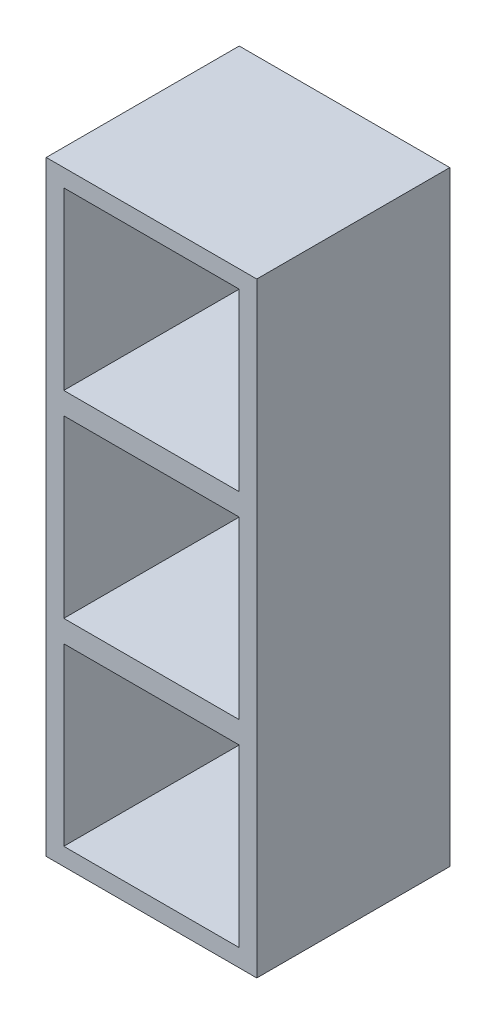
ISO-10303-21;
HEADER;
FILE_DESCRIPTION(('STEP AP214'),'2;1');
FILE_NAME('part.step','',(''),(''),'','','');
FILE_SCHEMA(('AUTOMOTIVE_DESIGN { 1 0 10303 214 1 1 1 1 }'));
ENDSEC;
DATA;
#1=APPLICATION_CONTEXT('core data for automotive mechanical design processes');
#2=APPLICATION_PROTOCOL_DEFINITION('international standard','automotive_design',2000,#1);
#3=PRODUCT_CONTEXT('',#1,'mechanical');
#4=PRODUCT('Part','Part','',(#3));
#5=PRODUCT_RELATED_PRODUCT_CATEGORY('part','',(#4));
#6=PRODUCT_DEFINITION_FORMATION('','',#4);
#7=PRODUCT_DEFINITION_CONTEXT('part definition',#1,'design');
#8=PRODUCT_DEFINITION('design','',#6,#7);
#9=PRODUCT_DEFINITION_SHAPE('','',#8);
#10=(LENGTH_UNIT() NAMED_UNIT(*) SI_UNIT(.MILLI.,.METRE.));
#11=(NAMED_UNIT(*) PLANE_ANGLE_UNIT() SI_UNIT($,.RADIAN.));
#12=(NAMED_UNIT(*) SI_UNIT($,.STERADIAN.) SOLID_ANGLE_UNIT());
#13=UNCERTAINTY_MEASURE_WITH_UNIT(LENGTH_MEASURE(1.E-05),#10,'distance_accuracy_value','');
#14=(GEOMETRIC_REPRESENTATION_CONTEXT(3) GLOBAL_UNCERTAINTY_ASSIGNED_CONTEXT((#13)) GLOBAL_UNIT_ASSIGNED_CONTEXT((#10,
#11,#12)) REPRESENTATION_CONTEXT('',''));
#15=CARTESIAN_POINT('',(0.,0.,0.));
#16=DIRECTION('',(0.,0.,1.));
#17=DIRECTION('',(1.,0.,0.));
#18=AXIS2_PLACEMENT_3D('',#15,#16,#17);
#19=CARTESIAN_POINT('',(4.,0.,44.));
#20=DIRECTION('',(1.,0.,0.));
#21=DIRECTION('',(0.,0.,-1.));
#22=AXIS2_PLACEMENT_3D('',#19,#20,#21);
#23=PLANE('',#22);
#24=DIRECTION('',(0.,-1.,0.));
#25=VECTOR('',#24,1.);
#26=CARTESIAN_POINT('',(4.,0.,4.));
#27=LINE('',#26,#25);
#28=CARTESIAN_POINT('',(4.,89.,4.));
#29=VERTEX_POINT('',#28);
#30=CARTESIAN_POINT('',(4.,49.,4.));
#31=VERTEX_POINT('',#30);
#32=EDGE_CURVE('E216',#29,#31,#27,.T.);
#33=ORIENTED_EDGE('',*,*,#32,.F.);
#34=DIRECTION('',(0.,0.,-1.));
#35=VECTOR('',#34,1.);
#36=CARTESIAN_POINT('',(3.99999999999984,89.,44.));
#37=LINE('',#36,#35);
#38=CARTESIAN_POINT('',(4.,89.,44.));
#39=VERTEX_POINT('',#38);
#40=EDGE_CURVE('E186',#39,#29,#37,.T.);
#41=ORIENTED_EDGE('',*,*,#40,.F.);
#42=DIRECTION('',(0.,-1.,0.));
#43=VECTOR('',#42,1.);
#44=CARTESIAN_POINT('',(4.,0.,44.));
#45=LINE('',#44,#43);
#46=CARTESIAN_POINT('',(4.,49.,44.));
#47=VERTEX_POINT('',#46);
#48=EDGE_CURVE('E239',#39,#47,#45,.T.);
#49=ORIENTED_EDGE('',*,*,#48,.T.);
#50=DIRECTION('',(0.,0.,-1.));
#51=VECTOR('',#50,1.);
#52=CARTESIAN_POINT('',(4.,49.,44.));
#53=LINE('',#52,#51);
#54=EDGE_CURVE('E197',#47,#31,#53,.T.);
#55=ORIENTED_EDGE('',*,*,#54,.T.);
#56=EDGE_LOOP('',(#33,#41,#49,#55));
#57=FACE_BOUND('',#56,.T.);
#58=ADVANCED_FACE('F37',(#57),#23,.T.);
#59=CARTESIAN_POINT('',(4.,134.,44.));
#60=VERTEX_POINT('',#59);
#61=CARTESIAN_POINT('',(4.,94.,44.));
#62=VERTEX_POINT('',#61);
#63=EDGE_CURVE('E237',#60,#62,#45,.T.);
#64=ORIENTED_EDGE('',*,*,#63,.T.);
#65=DIRECTION('',(0.,0.,-1.));
#66=VECTOR('',#65,1.);
#67=CARTESIAN_POINT('',(3.99999999999984,94.,44.));
#68=LINE('',#67,#66);
#69=CARTESIAN_POINT('',(4.,94.,4.));
#70=VERTEX_POINT('',#69);
#71=EDGE_CURVE('E60',#62,#70,#68,.T.);
#72=ORIENTED_EDGE('',*,*,#71,.T.);
#73=CARTESIAN_POINT('',(4.,134.,4.));
#74=VERTEX_POINT('',#73);
#75=EDGE_CURVE('E213',#74,#70,#27,.T.);
#76=ORIENTED_EDGE('',*,*,#75,.F.);
#77=DIRECTION('',(0.,0.,-1.));
#78=VECTOR('',#77,1.);
#79=CARTESIAN_POINT('',(4.,134.,44.));
#80=LINE('',#79,#78);
#81=EDGE_CURVE('E222',#60,#74,#80,.T.);
#82=ORIENTED_EDGE('',*,*,#81,.F.);
#83=EDGE_LOOP('',(#64,#72,#76,#82));
#84=FACE_BOUND('',#83,.T.);
#85=ADVANCED_FACE('F292',(#84),#23,.T.);
#86=CARTESIAN_POINT('',(44.,0.,44.));
#87=DIRECTION('',(-1.,0.,0.));
#88=DIRECTION('',(0.,0.,1.));
#89=AXIS2_PLACEMENT_3D('',#86,#87,#88);
#90=PLANE('',#89);
#91=DIRECTION('',(0.,1.,0.));
#92=VECTOR('',#91,1.);
#93=CARTESIAN_POINT('',(44.,0.,44.));
#94=LINE('',#93,#92);
#95=CARTESIAN_POINT('',(44.,49.,44.));
#96=VERTEX_POINT('',#95);
#97=CARTESIAN_POINT('',(44.,89.,44.));
#98=VERTEX_POINT('',#97);
#99=EDGE_CURVE('E162',#96,#98,#94,.T.);
#100=ORIENTED_EDGE('',*,*,#99,.T.);
#101=DIRECTION('',(0.,0.,-1.));
#102=VECTOR('',#101,1.);
#103=CARTESIAN_POINT('',(43.9999999999998,89.,44.));
#104=LINE('',#103,#102);
#105=CARTESIAN_POINT('',(44.,89.,4.));
#106=VERTEX_POINT('',#105);
#107=EDGE_CURVE('E173',#98,#106,#104,.T.);
#108=ORIENTED_EDGE('',*,*,#107,.T.);
#109=DIRECTION('',(0.,1.,0.));
#110=VECTOR('',#109,1.);
#111=CARTESIAN_POINT('',(44.,0.,4.));
#112=LINE('',#111,#110);
#113=CARTESIAN_POINT('',(44.,49.,4.));
#114=VERTEX_POINT('',#113);
#115=EDGE_CURVE('E233',#114,#106,#112,.T.);
#116=ORIENTED_EDGE('',*,*,#115,.F.);
#117=DIRECTION('',(0.,0.,-1.));
#118=VECTOR('',#117,1.);
#119=CARTESIAN_POINT('',(44.,49.,44.));
#120=LINE('',#119,#118);
#121=EDGE_CURVE('E204',#96,#114,#120,.T.);
#122=ORIENTED_EDGE('',*,*,#121,.F.);
#123=EDGE_LOOP('',(#100,#108,#116,#122));
#124=FACE_BOUND('',#123,.T.);
#125=ADVANCED_FACE('F299',(#124),#90,.T.);
#126=CARTESIAN_POINT('',(44.,94.,4.));
#127=VERTEX_POINT('',#126);
#128=CARTESIAN_POINT('',(44.,134.,4.));
#129=VERTEX_POINT('',#128);
#130=EDGE_CURVE('E170',#127,#129,#112,.T.);
#131=ORIENTED_EDGE('',*,*,#130,.F.);
#132=DIRECTION('',(0.,0.,-1.));
#133=VECTOR('',#132,1.);
#134=CARTESIAN_POINT('',(43.9999999999998,94.,44.));
#135=LINE('',#134,#133);
#136=CARTESIAN_POINT('',(43.9999999999998,94.,44.));
#137=VERTEX_POINT('',#136);
#138=EDGE_CURVE('E168',#137,#127,#135,.T.);
#139=ORIENTED_EDGE('',*,*,#138,.F.);
#140=CARTESIAN_POINT('',(44.,134.,44.));
#141=VERTEX_POINT('',#140);
#142=EDGE_CURVE('E152',#137,#141,#94,.T.);
#143=ORIENTED_EDGE('',*,*,#142,.T.);
#144=DIRECTION('',(0.,0.,-1.));
#145=VECTOR('',#144,1.);
#146=CARTESIAN_POINT('',(44.,134.,44.));
#147=LINE('',#146,#145);
#148=EDGE_CURVE('E225',#141,#129,#147,.T.);
#149=ORIENTED_EDGE('',*,*,#148,.T.);
#150=EDGE_LOOP('',(#131,#139,#143,#149));
#151=FACE_BOUND('',#150,.T.);
#152=ADVANCED_FACE('F169',(#151),#90,.T.);
#153=CARTESIAN_POINT('',(0.,0.,4.));
#154=DIRECTION('',(0.,0.,-1.));
#155=DIRECTION('',(-1.,0.,0.));
#156=AXIS2_PLACEMENT_3D('',#153,#154,#155);
#157=PLANE('',#156);
#158=DIRECTION('',(1.,0.,0.));
#159=VECTOR('',#158,1.);
#160=CARTESIAN_POINT('',(3.99999999999984,89.,4.));
#161=LINE('',#160,#159);
#162=EDGE_CURVE('E52',#29,#106,#161,.T.);
#163=ORIENTED_EDGE('',*,*,#162,.F.);
#164=ORIENTED_EDGE('',*,*,#32,.T.);
#165=DIRECTION('',(-1.,0.,0.));
#166=VECTOR('',#165,1.);
#167=CARTESIAN_POINT('',(4.,49.,4.));
#168=LINE('',#167,#166);
#169=EDGE_CURVE('E194',#114,#31,#168,.T.);
#170=ORIENTED_EDGE('',*,*,#169,.F.);
#171=ORIENTED_EDGE('',*,*,#115,.T.);
#172=EDGE_LOOP('',(#163,#164,#170,#171));
#173=FACE_BOUND('',#172,.T.);
#174=ADVANCED_FACE('F313',(#173),#157,.F.);
#175=DIRECTION('',(-1.,0.,0.));
#176=VECTOR('',#175,1.);
#177=CARTESIAN_POINT('',(3.99999999999984,94.,4.));
#178=LINE('',#177,#176);
#179=EDGE_CURVE('E180',#127,#70,#178,.T.);
#180=ORIENTED_EDGE('',*,*,#179,.F.);
#181=ORIENTED_EDGE('',*,*,#130,.T.);
#182=DIRECTION('',(-1.,0.,0.));
#183=VECTOR('',#182,1.);
#184=CARTESIAN_POINT('',(0.,134.,4.));
#185=LINE('',#184,#183);
#186=EDGE_CURVE('E232',#129,#74,#185,.T.);
#187=ORIENTED_EDGE('',*,*,#186,.T.);
#188=ORIENTED_EDGE('',*,*,#75,.T.);
#189=EDGE_LOOP('',(#180,#181,#187,#188));
#190=FACE_BOUND('',#189,.T.);
#191=ADVANCED_FACE('F304',(#190),#157,.F.);
#192=CARTESIAN_POINT('',(4.,44.,4.));
#193=VERTEX_POINT('',#192);
#194=CARTESIAN_POINT('',(4.,4.,4.));
#195=VERTEX_POINT('',#194);
#196=EDGE_CURVE('E212',#193,#195,#27,.T.);
#197=ORIENTED_EDGE('',*,*,#196,.F.);
#198=DIRECTION('',(0.,0.,-1.));
#199=VECTOR('',#198,1.);
#200=CARTESIAN_POINT('',(4.,44.,44.));
#201=LINE('',#200,#199);
#202=CARTESIAN_POINT('',(4.,44.,44.));
#203=VERTEX_POINT('',#202);
#204=EDGE_CURVE('E209',#203,#193,#201,.T.);
#205=ORIENTED_EDGE('',*,*,#204,.F.);
#206=CARTESIAN_POINT('',(4.,4.,44.));
#207=VERTEX_POINT('',#206);
#208=EDGE_CURVE('E236',#203,#207,#45,.T.);
#209=ORIENTED_EDGE('',*,*,#208,.T.);
#210=DIRECTION('',(0.,0.,-1.));
#211=VECTOR('',#210,1.);
#212=CARTESIAN_POINT('',(4.,4.,44.));
#213=LINE('',#212,#211);
#214=EDGE_CURVE('E217',#207,#195,#213,.T.);
#215=ORIENTED_EDGE('',*,*,#214,.T.);
#216=EDGE_LOOP('',(#197,#205,#209,#215));
#217=FACE_BOUND('',#216,.T.);
#218=ADVANCED_FACE('F295',(#217),#23,.T.);
#219=CARTESIAN_POINT('',(44.,4.,44.));
#220=VERTEX_POINT('',#219);
#221=CARTESIAN_POINT('',(44.,44.,44.));
#222=VERTEX_POINT('',#221);
#223=EDGE_CURVE('E165',#220,#222,#94,.T.);
#224=ORIENTED_EDGE('',*,*,#223,.T.);
#225=DIRECTION('',(0.,0.,-1.));
#226=VECTOR('',#225,1.);
#227=CARTESIAN_POINT('',(44.,44.,44.));
#228=LINE('',#227,#226);
#229=CARTESIAN_POINT('',(44.,44.,4.));
#230=VERTEX_POINT('',#229);
#231=EDGE_CURVE('E207',#222,#230,#228,.T.);
#232=ORIENTED_EDGE('',*,*,#231,.T.);
#233=CARTESIAN_POINT('',(44.,4.,4.));
#234=VERTEX_POINT('',#233);
#235=EDGE_CURVE('E229',#234,#230,#112,.T.);
#236=ORIENTED_EDGE('',*,*,#235,.F.);
#237=DIRECTION('',(0.,0.,-1.));
#238=VECTOR('',#237,1.);
#239=CARTESIAN_POINT('',(44.,4.,44.));
#240=LINE('',#239,#238);
#241=EDGE_CURVE('E221',#220,#234,#240,.T.);
#242=ORIENTED_EDGE('',*,*,#241,.F.);
#243=EDGE_LOOP('',(#224,#232,#236,#242));
#244=FACE_BOUND('',#243,.T.);
#245=ADVANCED_FACE('F303',(#244),#90,.T.);
#246=DIRECTION('',(1.,0.,0.));
#247=VECTOR('',#246,1.);
#248=CARTESIAN_POINT('',(4.,44.,4.));
#249=LINE('',#248,#247);
#250=EDGE_CURVE('E189',#193,#230,#249,.T.);
#251=ORIENTED_EDGE('',*,*,#250,.F.);
#252=ORIENTED_EDGE('',*,*,#196,.T.);
#253=DIRECTION('',(1.,0.,0.));
#254=VECTOR('',#253,1.);
#255=CARTESIAN_POINT('',(0.,4.,4.));
#256=LINE('',#255,#254);
#257=EDGE_CURVE('E215',#195,#234,#256,.T.);
#258=ORIENTED_EDGE('',*,*,#257,.T.);
#259=ORIENTED_EDGE('',*,*,#235,.T.);
#260=EDGE_LOOP('',(#251,#252,#258,#259));
#261=FACE_BOUND('',#260,.T.);
#262=ADVANCED_FACE('F310',(#261),#157,.F.);
#263=CARTESIAN_POINT('',(0.,0.,44.));
#264=DIRECTION('',(0.,0.,-1.));
#265=DIRECTION('',(-1.,0.,0.));
#266=AXIS2_PLACEMENT_3D('',#263,#264,#265);
#267=PLANE('',#266);
#268=ORIENTED_EDGE('',*,*,#48,.F.);
#269=DIRECTION('',(1.,0.,0.));
#270=VECTOR('',#269,1.);
#271=CARTESIAN_POINT('',(3.99999999999984,89.,44.));
#272=LINE('',#271,#270);
#273=EDGE_CURVE('E176',#39,#98,#272,.T.);
#274=ORIENTED_EDGE('',*,*,#273,.T.);
#275=ORIENTED_EDGE('',*,*,#99,.F.);
#276=DIRECTION('',(-1.,0.,0.));
#277=VECTOR('',#276,1.);
#278=CARTESIAN_POINT('',(4.,49.,44.));
#279=LINE('',#278,#277);
#280=EDGE_CURVE('E193',#96,#47,#279,.T.);
#281=ORIENTED_EDGE('',*,*,#280,.T.);
#282=EDGE_LOOP('',(#268,#274,#275,#281));
#283=FACE_BOUND('',#282,.T.);
#284=ORIENTED_EDGE('',*,*,#208,.F.);
#285=DIRECTION('',(1.,0.,0.));
#286=VECTOR('',#285,1.);
#287=CARTESIAN_POINT('',(4.,44.,44.));
#288=LINE('',#287,#286);
#289=EDGE_CURVE('E190',#203,#222,#288,.T.);
#290=ORIENTED_EDGE('',*,*,#289,.T.);
#291=ORIENTED_EDGE('',*,*,#223,.F.);
#292=DIRECTION('',(1.,0.,0.));
#293=VECTOR('',#292,1.);
#294=CARTESIAN_POINT('',(0.,4.,44.));
#295=LINE('',#294,#293);
#296=EDGE_CURVE('E163',#207,#220,#295,.T.);
#297=ORIENTED_EDGE('',*,*,#296,.F.);
#298=EDGE_LOOP('',(#284,#290,#291,#297));
#299=FACE_BOUND('',#298,.T.);
#300=DIRECTION('',(0.,-1.,0.));
#301=VECTOR('',#300,1.);
#302=CARTESIAN_POINT('',(0.,0.,44.));
#303=LINE('',#302,#301);
#304=CARTESIAN_POINT('',(0.,138.,44.));
#305=VERTEX_POINT('',#304);
#306=CARTESIAN_POINT('',(0.,0.,44.));
#307=VERTEX_POINT('',#306);
#308=EDGE_CURVE('E242',#305,#307,#303,.T.);
#309=ORIENTED_EDGE('',*,*,#308,.T.);
#310=DIRECTION('',(1.,0.,0.));
#311=VECTOR('',#310,1.);
#312=CARTESIAN_POINT('',(0.,0.,44.));
#313=LINE('',#312,#311);
#314=CARTESIAN_POINT('',(48.,0.,44.));
#315=VERTEX_POINT('',#314);
#316=EDGE_CURVE('E245',#307,#315,#313,.T.);
#317=ORIENTED_EDGE('',*,*,#316,.T.);
#318=DIRECTION('',(0.,1.,0.));
#319=VECTOR('',#318,1.);
#320=CARTESIAN_POINT('',(48.,0.,44.));
#321=LINE('',#320,#319);
#322=CARTESIAN_POINT('',(48.,138.,44.));
#323=VERTEX_POINT('',#322);
#324=EDGE_CURVE('E248',#315,#323,#321,.T.);
#325=ORIENTED_EDGE('',*,*,#324,.T.);
#326=DIRECTION('',(-1.,0.,0.));
#327=VECTOR('',#326,1.);
#328=CARTESIAN_POINT('',(0.,138.,44.));
#329=LINE('',#328,#327);
#330=EDGE_CURVE('E250',#323,#305,#329,.T.);
#331=ORIENTED_EDGE('',*,*,#330,.T.);
#332=EDGE_LOOP('',(#309,#317,#325,#331));
#333=FACE_BOUND('',#332,.T.);
#334=ORIENTED_EDGE('',*,*,#63,.F.);
#335=DIRECTION('',(-1.,0.,0.));
#336=VECTOR('',#335,1.);
#337=CARTESIAN_POINT('',(0.,134.,44.));
#338=LINE('',#337,#336);
#339=EDGE_CURVE('E158',#141,#60,#338,.T.);
#340=ORIENTED_EDGE('',*,*,#339,.F.);
#341=ORIENTED_EDGE('',*,*,#142,.F.);
#342=DIRECTION('',(-1.,0.,0.));
#343=VECTOR('',#342,1.);
#344=CARTESIAN_POINT('',(3.99999999999984,94.,44.));
#345=LINE('',#344,#343);
#346=EDGE_CURVE('E157',#137,#62,#345,.T.);
#347=ORIENTED_EDGE('',*,*,#346,.T.);
#348=EDGE_LOOP('',(#334,#340,#341,#347));
#349=FACE_BOUND('',#348,.T.);
#350=ADVANCED_FACE('F155',(#283,#299,#333,#349),#267,.F.);
#351=CARTESIAN_POINT('',(0.,0.,44.));
#352=DIRECTION('',(1.,0.,0.));
#353=DIRECTION('',(0.,0.,-1.));
#354=AXIS2_PLACEMENT_3D('',#351,#352,#353);
#355=PLANE('',#354);
#356=DIRECTION('',(0.,-1.,0.));
#357=VECTOR('',#356,1.);
#358=CARTESIAN_POINT('',(0.,0.,0.));
#359=LINE('',#358,#357);
#360=CARTESIAN_POINT('',(0.,138.,0.));
#361=VERTEX_POINT('',#360);
#362=CARTESIAN_POINT('',(0.,0.,0.));
#363=VERTEX_POINT('',#362);
#364=EDGE_CURVE('E220',#361,#363,#359,.T.);
#365=ORIENTED_EDGE('',*,*,#364,.T.);
#366=DIRECTION('',(0.,0.,-1.));
#367=VECTOR('',#366,1.);
#368=CARTESIAN_POINT('',(0.,0.,44.));
#369=LINE('',#368,#367);
#370=EDGE_CURVE('E11',#307,#363,#369,.T.);
#371=ORIENTED_EDGE('',*,*,#370,.F.);
#372=ORIENTED_EDGE('',*,*,#308,.F.);
#373=DIRECTION('',(0.,0.,-1.));
#374=VECTOR('',#373,1.);
#375=CARTESIAN_POINT('',(0.,138.,44.));
#376=LINE('',#375,#374);
#377=EDGE_CURVE('E252',#305,#361,#376,.T.);
#378=ORIENTED_EDGE('',*,*,#377,.T.);
#379=EDGE_LOOP('',(#365,#371,#372,#378));
#380=FACE_BOUND('',#379,.T.);
#381=ADVANCED_FACE('F39',(#380),#355,.F.);
#382=CARTESIAN_POINT('',(0.,0.,44.));
#383=DIRECTION('',(0.,1.,0.));
#384=DIRECTION('',(0.,0.,1.));
#385=AXIS2_PLACEMENT_3D('',#382,#383,#384);
#386=PLANE('',#385);
#387=DIRECTION('',(1.,0.,0.));
#388=VECTOR('',#387,1.);
#389=CARTESIAN_POINT('',(0.,0.,0.));
#390=LINE('',#389,#388);
#391=CARTESIAN_POINT('',(48.,0.,0.));
#392=VERTEX_POINT('',#391);
#393=EDGE_CURVE('E255',#363,#392,#390,.T.);
#394=ORIENTED_EDGE('',*,*,#393,.T.);
#395=DIRECTION('',(0.,0.,-1.));
#396=VECTOR('',#395,1.);
#397=CARTESIAN_POINT('',(48.,0.,44.));
#398=LINE('',#397,#396);
#399=EDGE_CURVE('E45',#315,#392,#398,.T.);
#400=ORIENTED_EDGE('',*,*,#399,.F.);
#401=ORIENTED_EDGE('',*,*,#316,.F.);
#402=ORIENTED_EDGE('',*,*,#370,.T.);
#403=EDGE_LOOP('',(#394,#400,#401,#402));
#404=FACE_BOUND('',#403,.T.);
#405=ADVANCED_FACE('F284',(#404),#386,.F.);
#406=CARTESIAN_POINT('',(48.,0.,44.));
#407=DIRECTION('',(-1.,0.,0.));
#408=DIRECTION('',(0.,0.,1.));
#409=AXIS2_PLACEMENT_3D('',#406,#407,#408);
#410=PLANE('',#409);
#411=DIRECTION('',(0.,1.,0.));
#412=VECTOR('',#411,1.);
#413=CARTESIAN_POINT('',(48.,0.,0.));
#414=LINE('',#413,#412);
#415=CARTESIAN_POINT('',(48.,138.,0.));
#416=VERTEX_POINT('',#415);
#417=EDGE_CURVE('E257',#392,#416,#414,.T.);
#418=ORIENTED_EDGE('',*,*,#417,.T.);
#419=DIRECTION('',(0.,0.,-1.));
#420=VECTOR('',#419,1.);
#421=CARTESIAN_POINT('',(48.,138.,44.));
#422=LINE('',#421,#420);
#423=EDGE_CURVE('E262',#323,#416,#422,.T.);
#424=ORIENTED_EDGE('',*,*,#423,.F.);
#425=ORIENTED_EDGE('',*,*,#324,.F.);
#426=ORIENTED_EDGE('',*,*,#399,.T.);
#427=EDGE_LOOP('',(#418,#424,#425,#426));
#428=FACE_BOUND('',#427,.T.);
#429=ADVANCED_FACE('F269',(#428),#410,.F.);
#430=CARTESIAN_POINT('',(0.,138.,44.));
#431=DIRECTION('',(0.,-1.,0.));
#432=DIRECTION('',(0.,0.,-1.));
#433=AXIS2_PLACEMENT_3D('',#430,#431,#432);
#434=PLANE('',#433);
#435=DIRECTION('',(-1.,0.,0.));
#436=VECTOR('',#435,1.);
#437=CARTESIAN_POINT('',(0.,138.,0.));
#438=LINE('',#437,#436);
#439=EDGE_CURVE('E246',#416,#361,#438,.T.);
#440=ORIENTED_EDGE('',*,*,#439,.T.);
#441=ORIENTED_EDGE('',*,*,#377,.F.);
#442=ORIENTED_EDGE('',*,*,#330,.F.);
#443=ORIENTED_EDGE('',*,*,#423,.T.);
#444=EDGE_LOOP('',(#440,#441,#442,#443));
#445=FACE_BOUND('',#444,.T.);
#446=ADVANCED_FACE('F278',(#445),#434,.F.);
#447=CARTESIAN_POINT('',(0.,0.,0.));
#448=DIRECTION('',(0.,0.,-1.));
#449=DIRECTION('',(-1.,0.,0.));
#450=AXIS2_PLACEMENT_3D('',#447,#448,#449);
#451=PLANE('',#450);
#452=ORIENTED_EDGE('',*,*,#364,.F.);
#453=ORIENTED_EDGE('',*,*,#439,.F.);
#454=ORIENTED_EDGE('',*,*,#417,.F.);
#455=ORIENTED_EDGE('',*,*,#393,.F.);
#456=EDGE_LOOP('',(#452,#453,#454,#455));
#457=FACE_BOUND('',#456,.T.);
#458=ADVANCED_FACE('F275',(#457),#451,.T.);
#459=CARTESIAN_POINT('',(0.,4.,44.));
#460=DIRECTION('',(0.,1.,0.));
#461=DIRECTION('',(0.,0.,1.));
#462=AXIS2_PLACEMENT_3D('',#459,#460,#461);
#463=PLANE('',#462);
#464=ORIENTED_EDGE('',*,*,#257,.F.);
#465=ORIENTED_EDGE('',*,*,#214,.F.);
#466=ORIENTED_EDGE('',*,*,#296,.T.);
#467=ORIENTED_EDGE('',*,*,#241,.T.);
#468=EDGE_LOOP('',(#464,#465,#466,#467));
#469=FACE_BOUND('',#468,.T.);
#470=ADVANCED_FACE('F344',(#469),#463,.T.);
#471=CARTESIAN_POINT('',(0.,134.,44.));
#472=DIRECTION('',(0.,-1.,0.));
#473=DIRECTION('',(0.,0.,-1.));
#474=AXIS2_PLACEMENT_3D('',#471,#472,#473);
#475=PLANE('',#474);
#476=ORIENTED_EDGE('',*,*,#186,.F.);
#477=ORIENTED_EDGE('',*,*,#148,.F.);
#478=ORIENTED_EDGE('',*,*,#339,.T.);
#479=ORIENTED_EDGE('',*,*,#81,.T.);
#480=EDGE_LOOP('',(#476,#477,#478,#479));
#481=FACE_BOUND('',#480,.T.);
#482=ADVANCED_FACE('F341',(#481),#475,.T.);
#483=CARTESIAN_POINT('',(4.,44.,44.));
#484=DIRECTION('',(0.,1.,0.));
#485=DIRECTION('',(0.,0.,1.));
#486=AXIS2_PLACEMENT_3D('',#483,#484,#485);
#487=PLANE('',#486);
#488=ORIENTED_EDGE('',*,*,#250,.T.);
#489=ORIENTED_EDGE('',*,*,#231,.F.);
#490=ORIENTED_EDGE('',*,*,#289,.F.);
#491=ORIENTED_EDGE('',*,*,#204,.T.);
#492=EDGE_LOOP('',(#488,#489,#490,#491));
#493=FACE_BOUND('',#492,.T.);
#494=ADVANCED_FACE('F323',(#493),#487,.F.);
#495=CARTESIAN_POINT('',(4.,49.,44.));
#496=DIRECTION('',(0.,-1.,0.));
#497=DIRECTION('',(1.,0.,0.));
#498=AXIS2_PLACEMENT_3D('',#495,#496,#497);
#499=PLANE('',#498);
#500=ORIENTED_EDGE('',*,*,#169,.T.);
#501=ORIENTED_EDGE('',*,*,#54,.F.);
#502=ORIENTED_EDGE('',*,*,#280,.F.);
#503=ORIENTED_EDGE('',*,*,#121,.T.);
#504=EDGE_LOOP('',(#500,#501,#502,#503));
#505=FACE_BOUND('',#504,.T.);
#506=ADVANCED_FACE('F335',(#505),#499,.F.);
#507=CARTESIAN_POINT('',(3.99999999999984,89.,44.));
#508=DIRECTION('',(0.,1.,0.));
#509=DIRECTION('',(0.,0.,1.));
#510=AXIS2_PLACEMENT_3D('',#507,#508,#509);
#511=PLANE('',#510);
#512=ORIENTED_EDGE('',*,*,#162,.T.);
#513=ORIENTED_EDGE('',*,*,#107,.F.);
#514=ORIENTED_EDGE('',*,*,#273,.F.);
#515=ORIENTED_EDGE('',*,*,#40,.T.);
#516=EDGE_LOOP('',(#512,#513,#514,#515));
#517=FACE_BOUND('',#516,.T.);
#518=ADVANCED_FACE('F450',(#517),#511,.F.);
#519=CARTESIAN_POINT('',(3.99999999999984,94.,44.));
#520=DIRECTION('',(0.,-1.,0.));
#521=DIRECTION('',(1.,0.,0.));
#522=AXIS2_PLACEMENT_3D('',#519,#520,#521);
#523=PLANE('',#522);
#524=ORIENTED_EDGE('',*,*,#179,.T.);
#525=ORIENTED_EDGE('',*,*,#71,.F.);
#526=ORIENTED_EDGE('',*,*,#346,.F.);
#527=ORIENTED_EDGE('',*,*,#138,.T.);
#528=EDGE_LOOP('',(#524,#525,#526,#527));
#529=FACE_BOUND('',#528,.T.);
#530=ADVANCED_FACE('F175',(#529),#523,.F.);
#531=CLOSED_SHELL('',(#58,#85,#125,#152,#174,#191,#218,#245,#262,#350,#381,#405,#429,#446,#458,
#470,#482,#494,#506,#518,#530));
#532=MANIFOLD_SOLID_BREP('B2',#531);
#533=ADVANCED_BREP_SHAPE_REPRESENTATION('',(#18,#532),#14);
#534=SHAPE_DEFINITION_REPRESENTATION(#9,#533);
ENDSEC;
END-ISO-10303-21;
